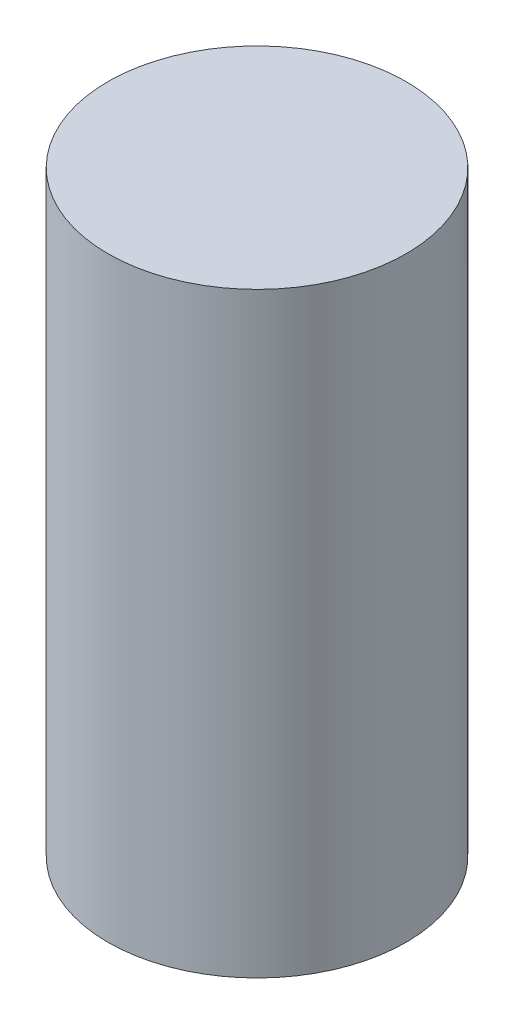
ISO-10303-21;
HEADER;
FILE_DESCRIPTION(('STEP AP214'),'2;1');
FILE_NAME('part.step','',(''),(''),'','','');
FILE_SCHEMA(('AUTOMOTIVE_DESIGN { 1 0 10303 214 1 1 1 1 }'));
ENDSEC;
DATA;
#1=APPLICATION_CONTEXT('core data for automotive mechanical design processes');
#2=APPLICATION_PROTOCOL_DEFINITION('international standard','automotive_design',2000,#1);
#3=PRODUCT_CONTEXT('',#1,'mechanical');
#4=PRODUCT('Part','Part','',(#3));
#5=PRODUCT_RELATED_PRODUCT_CATEGORY('part','',(#4));
#6=PRODUCT_DEFINITION_FORMATION('','',#4);
#7=PRODUCT_DEFINITION_CONTEXT('part definition',#1,'design');
#8=PRODUCT_DEFINITION('design','',#6,#7);
#9=PRODUCT_DEFINITION_SHAPE('','',#8);
#10=(LENGTH_UNIT() NAMED_UNIT(*) SI_UNIT(.MILLI.,.METRE.));
#11=(NAMED_UNIT(*) PLANE_ANGLE_UNIT() SI_UNIT($,.RADIAN.));
#12=(NAMED_UNIT(*) SI_UNIT($,.STERADIAN.) SOLID_ANGLE_UNIT());
#13=UNCERTAINTY_MEASURE_WITH_UNIT(LENGTH_MEASURE(1.E-05),#10,'distance_accuracy_value','');
#14=(GEOMETRIC_REPRESENTATION_CONTEXT(3) GLOBAL_UNCERTAINTY_ASSIGNED_CONTEXT((#13)) GLOBAL_UNIT_ASSIGNED_CONTEXT((#10,
#11,#12)) REPRESENTATION_CONTEXT('',''));
#15=CARTESIAN_POINT('',(0.,0.,0.));
#16=DIRECTION('',(0.,0.,1.));
#17=DIRECTION('',(1.,0.,0.));
#18=AXIS2_PLACEMENT_3D('',#15,#16,#17);
#19=CARTESIAN_POINT('',(0.,400.,0.));
#20=DIRECTION('',(0.,-1.,0.));
#21=DIRECTION('',(0.,0.,-1.));
#22=AXIS2_PLACEMENT_3D('',#19,#20,#21);
#23=CYLINDRICAL_SURFACE('',#22,100.);
#24=CARTESIAN_POINT('',(0.,400.,0.));
#25=DIRECTION('',(0.,1.,0.));
#26=DIRECTION('',(0.,0.,1.));
#27=AXIS2_PLACEMENT_3D('',#24,#25,#26);
#28=CIRCLE('',#27,100.);
#29=CARTESIAN_POINT('',(0.,400.,100.));
#30=VERTEX_POINT('',#29);
#31=EDGE_CURVE('E10',#30,#30,#28,.T.);
#32=ORIENTED_EDGE('',*,*,#31,.F.);
#33=EDGE_LOOP('',(#32));
#34=FACE_BOUND('',#33,.T.);
#35=CARTESIAN_POINT('',(0.,0.,0.));
#36=DIRECTION('',(0.,1.,0.));
#37=DIRECTION('',(0.,0.,1.));
#38=AXIS2_PLACEMENT_3D('',#35,#36,#37);
#39=CIRCLE('',#38,100.);
#40=CARTESIAN_POINT('',(0.,0.,100.));
#41=VERTEX_POINT('',#40);
#42=EDGE_CURVE('E42',#41,#41,#39,.T.);
#43=ORIENTED_EDGE('',*,*,#42,.T.);
#44=EDGE_LOOP('',(#43));
#45=FACE_BOUND('',#44,.T.);
#46=ADVANCED_FACE('F39',(#34,#45),#23,.T.);
#47=CARTESIAN_POINT('',(0.,400.,0.));
#48=DIRECTION('',(0.,1.,0.));
#49=DIRECTION('',(0.,0.,1.));
#50=AXIS2_PLACEMENT_3D('',#47,#48,#49);
#51=PLANE('',#50);
#52=ORIENTED_EDGE('',*,*,#31,.T.);
#53=EDGE_LOOP('',(#52));
#54=FACE_BOUND('',#53,.T.);
#55=ADVANCED_FACE('F54',(#54),#51,.T.);
#56=CARTESIAN_POINT('',(0.,0.,0.));
#57=DIRECTION('',(0.,1.,0.));
#58=DIRECTION('',(0.,0.,1.));
#59=AXIS2_PLACEMENT_3D('',#56,#57,#58);
#60=PLANE('',#59);
#61=ORIENTED_EDGE('',*,*,#42,.F.);
#62=EDGE_LOOP('',(#61));
#63=FACE_BOUND('',#62,.T.);
#64=ADVANCED_FACE('F52',(#63),#60,.F.);
#65=CLOSED_SHELL('',(#46,#55,#64));
#66=MANIFOLD_SOLID_BREP('B2',#65);
#67=ADVANCED_BREP_SHAPE_REPRESENTATION('',(#18,#66),#14);
#68=SHAPE_DEFINITION_REPRESENTATION(#9,#67);
ENDSEC;
END-ISO-10303-21;
